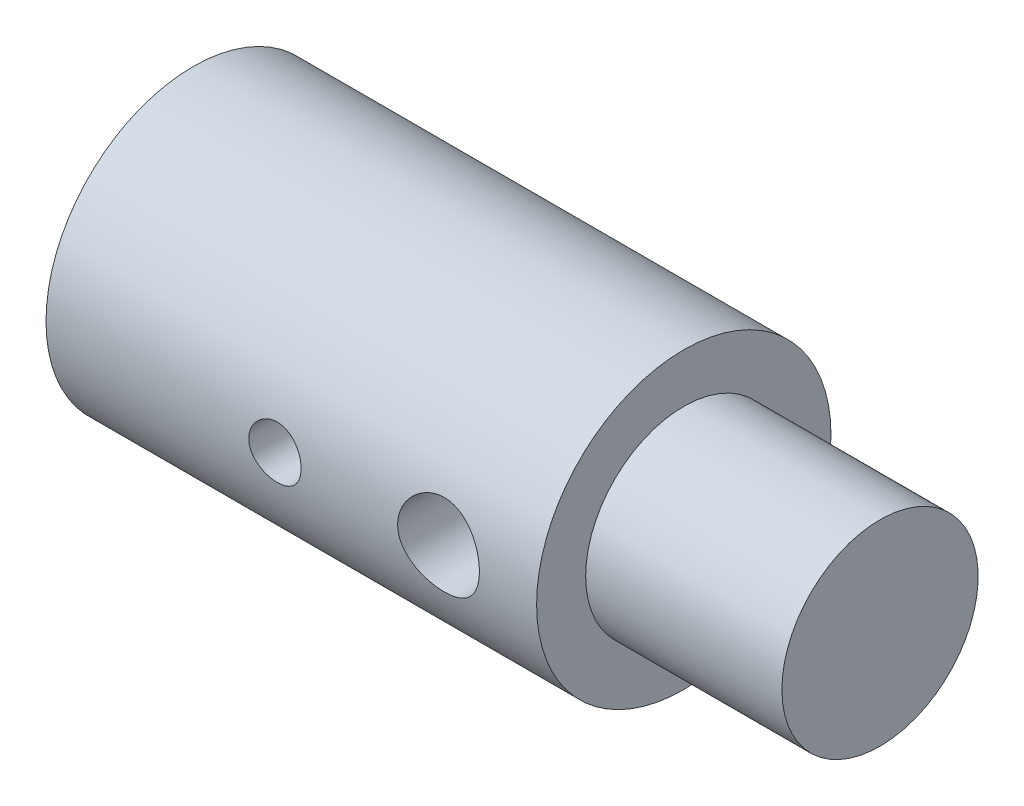
ISO-10303-21;
HEADER;
FILE_DESCRIPTION(('STEP AP214'),'2;1');
FILE_NAME('part.step','',(''),(''),'','','');
FILE_SCHEMA(('AUTOMOTIVE_DESIGN { 1 0 10303 214 1 1 1 1 }'));
ENDSEC;
DATA;
#1=APPLICATION_CONTEXT('core data for automotive mechanical design processes');
#2=APPLICATION_PROTOCOL_DEFINITION('international standard','automotive_design',2000,#1);
#3=PRODUCT_CONTEXT('',#1,'mechanical');
#4=PRODUCT('Part','Part','',(#3));
#5=PRODUCT_RELATED_PRODUCT_CATEGORY('part','',(#4));
#6=PRODUCT_DEFINITION_FORMATION('','',#4);
#7=PRODUCT_DEFINITION_CONTEXT('part definition',#1,'design');
#8=PRODUCT_DEFINITION('design','',#6,#7);
#9=PRODUCT_DEFINITION_SHAPE('','',#8);
#10=(LENGTH_UNIT() NAMED_UNIT(*) SI_UNIT(.MILLI.,.METRE.));
#11=(NAMED_UNIT(*) PLANE_ANGLE_UNIT() SI_UNIT($,.RADIAN.));
#12=(NAMED_UNIT(*) SI_UNIT($,.STERADIAN.) SOLID_ANGLE_UNIT());
#13=UNCERTAINTY_MEASURE_WITH_UNIT(LENGTH_MEASURE(1.E-05),#10,'distance_accuracy_value','');
#14=(GEOMETRIC_REPRESENTATION_CONTEXT(3) GLOBAL_UNCERTAINTY_ASSIGNED_CONTEXT((#13)) GLOBAL_UNIT_ASSIGNED_CONTEXT((#10,
#11,#12)) REPRESENTATION_CONTEXT('',''));
#15=CARTESIAN_POINT('',(0.,0.,0.));
#16=DIRECTION('',(0.,0.,1.));
#17=DIRECTION('',(1.,0.,0.));
#18=AXIS2_PLACEMENT_3D('',#15,#16,#17);
#19=CARTESIAN_POINT('',(0.,0.,0.));
#20=DIRECTION('',(-1.,0.,0.));
#21=DIRECTION('',(0.,0.,1.));
#22=AXIS2_PLACEMENT_3D('',#19,#20,#21);
#23=CYLINDRICAL_SURFACE('',#22,4.5);
#24=CARTESIAN_POINT('',(13.25,0.,-4.5));
#25=CARTESIAN_POINT('',(13.2499986004148,0.0688012508831792,-4.49999908016929));
#26=CARTESIAN_POINT('',(13.2443006801947,0.137617123752667,-4.49840674086833));
#27=CARTESIAN_POINT('',(13.2217042717347,0.273259475994238,-4.49220950198236));
#28=CARTESIAN_POINT('',(13.2048010582863,0.340085103663439,-4.48760333149253));
#29=CARTESIAN_POINT('',(13.1603912805861,0.469769949680302,-4.47588565394594));
#30=CARTESIAN_POINT('',(13.1328990313016,0.53263439009567,-4.46877753030964));
#31=CARTESIAN_POINT('',(13.0681464936731,0.652860695241772,-4.45280312581996));
#32=CARTESIAN_POINT('',(13.0308853380807,0.710222070812297,-4.44393668888688));
#33=CARTESIAN_POINT('',(12.9466705661571,0.819246784715924,-4.4251515781749));
#34=CARTESIAN_POINT('',(12.8995179603125,0.870753112808475,-4.41521373623696));
#35=CARTESIAN_POINT('',(12.7972837228784,0.965238185696339,-4.39552607117256));
#36=CARTESIAN_POINT('',(12.7422009777248,1.00821573084554,-4.38577627467017));
#37=CARTESIAN_POINT('',(12.6243927398707,1.08520808580323,-4.36737044294547));
#38=CARTESIAN_POINT('',(12.5615427915563,1.11903874947837,-4.35873847945984));
#39=CARTESIAN_POINT('',(12.4307680823599,1.1755895713114,-4.34382900808304));
#40=CARTESIAN_POINT('',(12.3628443495918,1.19831197336242,-4.33755102474248));
#41=CARTESIAN_POINT('',(12.2255972111459,1.23144924367956,-4.32825883142877));
#42=CARTESIAN_POINT('',(12.1563481783601,1.24215036904297,-4.32516886003198));
#43=CARTESIAN_POINT('',(12.0169741144372,1.25183427077973,-4.32237649384803));
#44=CARTESIAN_POINT('',(11.9468492651188,1.25081944027303,-4.3226734072502));
#45=CARTESIAN_POINT('',(11.8099777212773,1.2373267133762,-4.32655366801453));
#46=CARTESIAN_POINT('',(11.7431931985038,1.22519902270671,-4.33003660668585));
#47=CARTESIAN_POINT('',(11.6126463714084,1.19038731201905,-4.33973517053475));
#48=CARTESIAN_POINT('',(11.5488843273977,1.16770238457158,-4.3459510306134));
#49=CARTESIAN_POINT('',(11.4252977685447,1.11214373134465,-4.36050069775752));
#50=CARTESIAN_POINT('',(11.3655301331899,1.07915021836991,-4.36885918600197));
#51=CARTESIAN_POINT('',(11.2522584244088,1.00399440679636,-4.386739506843));
#52=CARTESIAN_POINT('',(11.1987556812739,0.961830166290604,-4.39626158564315));
#53=CARTESIAN_POINT('',(11.0975361195636,0.867755610284442,-4.41581072126827));
#54=CARTESIAN_POINT('',(11.0500923651201,0.815552279702357,-4.42584370037791));
#55=CARTESIAN_POINT('',(10.9645742692222,0.703806607201037,-4.44498199810828));
#56=CARTESIAN_POINT('',(10.9265003618975,0.644263925421966,-4.45408727373461));
#57=CARTESIAN_POINT('',(10.8606681843699,0.519083429338116,-4.47040839712755));
#58=CARTESIAN_POINT('',(10.8329628960611,0.453416395747749,-4.47761448645532));
#59=CARTESIAN_POINT('',(10.7890659015586,0.318109988769716,-4.48925492501446));
#60=CARTESIAN_POINT('',(10.7728714578434,0.248471564121132,-4.49368993323699));
#61=CARTESIAN_POINT('',(10.752892863221,0.109526607713143,-4.49918736483408));
#62=CARTESIAN_POINT('',(10.7487378550928,0.0402773058586824,-4.5003505382403));
#63=CARTESIAN_POINT('',(10.7519269982924,-0.0979299306365661,-4.49946480293159));
#64=CARTESIAN_POINT('',(10.759269851648,-0.166887897284517,-4.49741625678167));
#65=CARTESIAN_POINT('',(10.7849433341196,-0.301206913470859,-4.49040265059029));
#66=CARTESIAN_POINT('',(10.8030639450575,-0.366611288163866,-4.4854933716758));
#67=CARTESIAN_POINT('',(10.8495318676381,-0.49344311811872,-4.47331829169354));
#68=CARTESIAN_POINT('',(10.8778803325695,-0.554870123972382,-4.46605222488463));
#69=CARTESIAN_POINT('',(10.9446658780465,-0.673420140405416,-4.44973740284175));
#70=CARTESIAN_POINT('',(10.9833005243227,-0.730427061953541,-4.44065471340565));
#71=CARTESIAN_POINT('',(11.0693161358075,-0.837277670587,-4.42175477128212));
#72=CARTESIAN_POINT('',(11.1166989800658,-0.887119814631375,-4.41193736105189));
#73=CARTESIAN_POINT('',(11.2206014438783,-0.979812026944952,-4.39229842684379));
#74=CARTESIAN_POINT('',(11.2773574515576,-1.02239957885383,-4.3824860820796));
#75=CARTESIAN_POINT('',(11.3974206378797,-1.09745581429008,-4.36429693304267));
#76=CARTESIAN_POINT('',(11.4607275658426,-1.12992488482463,-4.35592007387163));
#77=CARTESIAN_POINT('',(11.5918071698832,-1.18358105834153,-4.34164798956173));
#78=CARTESIAN_POINT('',(11.6595526377546,-1.20483077484783,-4.3357390309604));
#79=CARTESIAN_POINT('',(11.7978497094168,-1.23557652495357,-4.32707876892783));
#80=CARTESIAN_POINT('',(11.8684005146331,-1.24507587906573,-4.32432657344886));
#81=CARTESIAN_POINT('',(12.0076057794908,-1.25184859974322,-4.32237038329875));
#82=CARTESIAN_POINT('',(12.0762381900119,-1.24954571014582,-4.32304340461176));
#83=CARTESIAN_POINT('',(12.2120948937947,-1.23377143287258,-4.32757137052123));
#84=CARTESIAN_POINT('',(12.2793192292682,-1.22030038049411,-4.33142621959091));
#85=CARTESIAN_POINT('',(12.4098672339181,-1.18282724248615,-4.34180718808003));
#86=CARTESIAN_POINT('',(12.4732208426478,-1.15892214641117,-4.34830866913275));
#87=CARTESIAN_POINT('',(12.5950674225073,-1.10133451670734,-4.36324916052054));
#88=CARTESIAN_POINT('',(12.6535595714857,-1.06765033358688,-4.37168849767404));
#89=CARTESIAN_POINT('',(12.7660276528252,-0.990206962020975,-4.38988810785379));
#90=CARTESIAN_POINT('',(12.8198014766827,-0.946162084346269,-4.39968178982262));
#91=CARTESIAN_POINT('',(12.9193323720535,-0.849781527450665,-4.41930831909362));
#92=CARTESIAN_POINT('',(12.965087452891,-0.797443795628193,-4.4291411755031));
#93=CARTESIAN_POINT('',(13.0483581365781,-0.684460232307883,-4.44801839581548));
#94=CARTESIAN_POINT('',(13.0856516233107,-0.623646258932176,-4.45703841192792));
#95=CARTESIAN_POINT('',(13.1494281392895,-0.496361982692843,-4.47299974900605));
#96=CARTESIAN_POINT('',(13.175917518581,-0.429895030176727,-4.47994229035335));
#97=CARTESIAN_POINT('',(13.2142200807347,-0.303145483766702,-4.4901607483195));
#98=CARTESIAN_POINT('',(13.2276047875929,-0.243364402168743,-4.49382245661855));
#99=CARTESIAN_POINT('',(13.2454948458225,-0.12239262569341,-4.49874234976285));
#100=CARTESIAN_POINT('',(13.2500012449999,-0.0612020980194156,-4.50000081823467));
#101=CARTESIAN_POINT('',(13.25,0.,-4.5));
#102=B_SPLINE_CURVE_WITH_KNOTS('',3,(#24,#25,#26,#27,#28,#29,#30,#31,#32,#33,#34,#35,#36,#37,
#38,#39,#40,#41,#42,#43,#44,#45,#46,#47,#48,#49,#50,#51,#52,#53,#54,#55,#56,#57,#58,#59,#60,#61,
#62,#63,#64,#65,#66,#67,#68,#69,#70,#71,#72,#73,#74,#75,#76,#77,#78,#79,#80,#81,#82,#83,#84,#85,
#86,#87,#88,#89,#90,#91,#92,#93,#94,#95,#96,#97,#98,#99,#100,#101),.UNSPECIFIED.,.T.,.F.,(4,2,2,
2,2,2,2,2,2,2,2,2,2,2,2,2,2,2,2,2,2,2,2,2,2,2,2,2,2,2,2,2,2,2,2,2,2,2,4),(0.,0.20617919309949,
0.412445386147261,0.618433707942855,0.824440322837931,1.03507624325264,1.24574177043995,
1.46037690323672,1.67496866133384,1.8843343193919,2.09365721284144,2.29660232990422,
2.49956489399153,2.70497960040656,2.91043784592675,3.12319493838162,3.33596188658146,
3.5498016563595,3.76359055350007,3.97072010588427,4.17782627748477,4.38102317477487,
4.58424299163039,4.79168948884227,4.99918059600964,5.21305991702851,5.42693105668201,
5.63959564853972,5.85220013017267,6.05722599244308,6.26224569952549,6.46539893556025,
6.66858645848129,6.87821913273771,7.0879037754062,7.30258090584733,7.51713167871719,
7.7005598652503,7.88396640253935),.UNSPECIFIED.);
#103=CARTESIAN_POINT('',(13.25,0.,-4.5));
#104=VERTEX_POINT('',#103);
#105=EDGE_CURVE('E97',#104,#104,#102,.T.);
#106=ORIENTED_EDGE('',*,*,#105,.T.);
#107=EDGE_LOOP('',(#106));
#108=FACE_BOUND('',#107,.T.);
#109=CARTESIAN_POINT('',(13.25,0.,4.5));
#110=CARTESIAN_POINT('',(13.2499986004148,-0.0688012508831791,4.49999908016929));
#111=CARTESIAN_POINT('',(13.2443006801947,-0.137617123752667,4.49840674086833));
#112=CARTESIAN_POINT('',(13.2217042717347,-0.273259475994238,4.49220950198236));
#113=CARTESIAN_POINT('',(13.2048010582863,-0.340085103663439,4.48760333149253));
#114=CARTESIAN_POINT('',(13.1603912805861,-0.469769949680302,4.47588565394594));
#115=CARTESIAN_POINT('',(13.1328990313016,-0.53263439009567,4.46877753030964));
#116=CARTESIAN_POINT('',(13.0681464936731,-0.652860695241772,4.45280312581996));
#117=CARTESIAN_POINT('',(13.0308853380807,-0.710222070812297,4.44393668888688));
#118=CARTESIAN_POINT('',(12.9466705661571,-0.819246784715924,4.4251515781749));
#119=CARTESIAN_POINT('',(12.8995179603125,-0.870753112808474,4.41521373623696));
#120=CARTESIAN_POINT('',(12.7972837228784,-0.965238185696338,4.39552607117256));
#121=CARTESIAN_POINT('',(12.7422009777248,-1.00821573084554,4.38577627467017));
#122=CARTESIAN_POINT('',(12.6243927398707,-1.08520808580323,4.36737044294547));
#123=CARTESIAN_POINT('',(12.5615427915563,-1.11903874947837,4.35873847945984));
#124=CARTESIAN_POINT('',(12.4307680823599,-1.1755895713114,4.34382900808304));
#125=CARTESIAN_POINT('',(12.3628443495918,-1.19831197336242,4.33755102474248));
#126=CARTESIAN_POINT('',(12.2255972111459,-1.23144924367956,4.32825883142877));
#127=CARTESIAN_POINT('',(12.1563481783601,-1.24215036904297,4.32516886003198));
#128=CARTESIAN_POINT('',(12.0169741144372,-1.25183427077973,4.32237649384803));
#129=CARTESIAN_POINT('',(11.9468492651188,-1.25081944027303,4.3226734072502));
#130=CARTESIAN_POINT('',(11.8099777212773,-1.2373267133762,4.32655366801453));
#131=CARTESIAN_POINT('',(11.7431931985038,-1.22519902270671,4.33003660668585));
#132=CARTESIAN_POINT('',(11.6126463714084,-1.19038731201905,4.33973517053475));
#133=CARTESIAN_POINT('',(11.5488843273977,-1.16770238457158,4.3459510306134));
#134=CARTESIAN_POINT('',(11.4252977685447,-1.11214373134465,4.36050069775752));
#135=CARTESIAN_POINT('',(11.3655301331899,-1.07915021836991,4.36885918600197));
#136=CARTESIAN_POINT('',(11.2522584244088,-1.00399440679636,4.386739506843));
#137=CARTESIAN_POINT('',(11.1987556812739,-0.961830166290604,4.39626158564315));
#138=CARTESIAN_POINT('',(11.0975361195636,-0.867755610284442,4.41581072126827));
#139=CARTESIAN_POINT('',(11.0500923651201,-0.815552279702357,4.42584370037791));
#140=CARTESIAN_POINT('',(10.9645742692222,-0.703806607201037,4.44498199810828));
#141=CARTESIAN_POINT('',(10.9265003618975,-0.644263925421966,4.45408727373461));
#142=CARTESIAN_POINT('',(10.8606681843699,-0.519083429338116,4.47040839712755));
#143=CARTESIAN_POINT('',(10.8329628960611,-0.453416395747749,4.47761448645532));
#144=CARTESIAN_POINT('',(10.7890659015586,-0.318109988769716,4.48925492501446));
#145=CARTESIAN_POINT('',(10.7728714578434,-0.248471564121132,4.49368993323699));
#146=CARTESIAN_POINT('',(10.752892863221,-0.109526607713143,4.49918736483408));
#147=CARTESIAN_POINT('',(10.7487378550928,-0.0402773058586822,4.5003505382403));
#148=CARTESIAN_POINT('',(10.7519269982924,0.0979299306365663,4.49946480293159));
#149=CARTESIAN_POINT('',(10.759269851648,0.166887897284518,4.49741625678167));
#150=CARTESIAN_POINT('',(10.7849433341196,0.30120691347086,4.49040265059029));
#151=CARTESIAN_POINT('',(10.8030639450575,0.366611288163866,4.4854933716758));
#152=CARTESIAN_POINT('',(10.8495318676381,0.49344311811872,4.47331829169354));
#153=CARTESIAN_POINT('',(10.8778803325695,0.554870123972381,4.46605222488463));
#154=CARTESIAN_POINT('',(10.9446658780465,0.673420140405416,4.44973740284175));
#155=CARTESIAN_POINT('',(10.9833005243227,0.730427061953542,4.44065471340565));
#156=CARTESIAN_POINT('',(11.0693161358075,0.837277670587,4.42175477128212));
#157=CARTESIAN_POINT('',(11.1166989800658,0.887119814631376,4.41193736105189));
#158=CARTESIAN_POINT('',(11.2206014438783,0.979812026944952,4.39229842684379));
#159=CARTESIAN_POINT('',(11.2773574515576,1.02239957885383,4.3824860820796));
#160=CARTESIAN_POINT('',(11.3974206378797,1.09745581429008,4.36429693304267));
#161=CARTESIAN_POINT('',(11.4607275658426,1.12992488482463,4.35592007387163));
#162=CARTESIAN_POINT('',(11.5918071698832,1.18358105834153,4.34164798956173));
#163=CARTESIAN_POINT('',(11.6595526377546,1.20483077484783,4.3357390309604));
#164=CARTESIAN_POINT('',(11.7978497094168,1.23557652495357,4.32707876892783));
#165=CARTESIAN_POINT('',(11.8684005146331,1.24507587906573,4.32432657344886));
#166=CARTESIAN_POINT('',(12.0076057794908,1.25184859974322,4.32237038329875));
#167=CARTESIAN_POINT('',(12.0762381900119,1.24954571014582,4.32304340461176));
#168=CARTESIAN_POINT('',(12.2120948937947,1.23377143287258,4.32757137052123));
#169=CARTESIAN_POINT('',(12.2793192292682,1.22030038049411,4.33142621959091));
#170=CARTESIAN_POINT('',(12.4098672339181,1.18282724248615,4.34180718808003));
#171=CARTESIAN_POINT('',(12.4732208426478,1.15892214641117,4.34830866913275));
#172=CARTESIAN_POINT('',(12.5950674225073,1.10133451670734,4.36324916052054));
#173=CARTESIAN_POINT('',(12.6535595714857,1.06765033358688,4.37168849767404));
#174=CARTESIAN_POINT('',(12.7660276528252,0.990206962020974,4.38988810785379));
#175=CARTESIAN_POINT('',(12.8198014766827,0.946162084346268,4.39968178982262));
#176=CARTESIAN_POINT('',(12.9193323720535,0.849781527450665,4.41930831909362));
#177=CARTESIAN_POINT('',(12.965087452891,0.797443795628193,4.4291411755031));
#178=CARTESIAN_POINT('',(13.0483581365781,0.684460232307883,4.44801839581548));
#179=CARTESIAN_POINT('',(13.0856516233107,0.623646258932176,4.45703841192792));
#180=CARTESIAN_POINT('',(13.1494281392895,0.496361982692843,4.47299974900605));
#181=CARTESIAN_POINT('',(13.175917518581,0.429895030176727,4.47994229035335));
#182=CARTESIAN_POINT('',(13.2142200807347,0.303145483766702,4.4901607483195));
#183=CARTESIAN_POINT('',(13.2276047875929,0.243364402168743,4.49382245661855));
#184=CARTESIAN_POINT('',(13.2454948458225,0.12239262569341,4.49874234976285));
#185=CARTESIAN_POINT('',(13.2500012449999,0.0612020980194157,4.50000081823467));
#186=CARTESIAN_POINT('',(13.25,0.,4.5));
#187=B_SPLINE_CURVE_WITH_KNOTS('',3,(#109,#110,#111,#112,#113,#114,#115,#116,#117,#118,#119,
#120,#121,#122,#123,#124,#125,#126,#127,#128,#129,#130,#131,#132,#133,#134,#135,#136,#137,#138,
#139,#140,#141,#142,#143,#144,#145,#146,#147,#148,#149,#150,#151,#152,#153,#154,#155,#156,#157,
#158,#159,#160,#161,#162,#163,#164,#165,#166,#167,#168,#169,#170,#171,#172,#173,#174,#175,#176,
#177,#178,#179,#180,#181,#182,#183,#184,#185,#186),.UNSPECIFIED.,.T.,.F.,(4,2,2,2,2,2,2,2,2,2,2,
2,2,2,2,2,2,2,2,2,2,2,2,2,2,2,2,2,2,2,2,2,2,2,2,2,2,2,4),(0.,0.20617919309949,0.41244538614726,
0.618433707942855,0.82444032283793,1.03507624325264,1.24574177043995,1.46037690323672,
1.67496866133384,1.8843343193919,2.09365721284144,2.29660232990422,2.49956489399153,
2.70497960040656,2.91043784592675,3.12319493838162,3.33596188658146,3.5498016563595,
3.76359055350007,3.97072010588427,4.17782627748477,4.38102317477487,4.58424299163039,
4.79168948884227,4.99918059600964,5.21305991702851,5.42693105668201,5.63959564853972,
5.85220013017267,6.05722599244308,6.26224569952549,6.46539893556025,6.66858645848129,
6.87821913273771,7.0879037754062,7.30258090584733,7.51713167871719,7.7005598652503,
7.88396640253935),.UNSPECIFIED.);
#188=CARTESIAN_POINT('',(13.25,0.,4.5));
#189=VERTEX_POINT('',#188);
#190=EDGE_CURVE('E203',#189,#189,#187,.T.);
#191=ORIENTED_EDGE('',*,*,#190,.T.);
#192=EDGE_LOOP('',(#191));
#193=FACE_BOUND('',#192,.T.);
#194=CARTESIAN_POINT('',(6.20000000000001,0.,4.5));
#195=CARTESIAN_POINT('',(6.20000174500124,0.0445599944511058,4.4999992105062));
#196=CARTESIAN_POINT('',(6.20373556648194,0.0891431869059652,4.49933127269273));
#197=CARTESIAN_POINT('',(6.21856422299493,0.177056081488532,4.49673108581177));
#198=CARTESIAN_POINT('',(6.22966553814751,0.220384645056034,4.49479772375394));
#199=CARTESIAN_POINT('',(6.25888085396563,0.304503908341068,4.48988323923955));
#200=CARTESIAN_POINT('',(6.27698880684739,0.345296761610666,4.48690302058187));
#201=CARTESIAN_POINT('',(6.31968683870222,0.423260819916551,4.48022133695395));
#202=CARTESIAN_POINT('',(6.34427628948374,0.460432375453759,4.47651994188972));
#203=CARTESIAN_POINT('',(6.39952194520398,0.530505214569471,4.46876053693121));
#204=CARTESIAN_POINT('',(6.43023460469286,0.563361649877269,4.46469942018057));
#205=CARTESIAN_POINT('',(6.49673337361036,0.623483866791267,4.45670168733634));
#206=CARTESIAN_POINT('',(6.53251982534165,0.650749270895478,4.45276507966468));
#207=CARTESIAN_POINT('',(6.60846305347863,0.699098750783088,4.44543195001283));
#208=CARTESIAN_POINT('',(6.6486489092434,0.720137812784376,4.44203943857662));
#209=CARTESIAN_POINT('',(6.73205494879309,0.755149375735973,4.4362220868588));
#210=CARTESIAN_POINT('',(6.77527489810219,0.769122422067297,4.43379717189759));
#211=CARTESIAN_POINT('',(6.86304448235446,0.789462626371859,4.43022068885813));
#212=CARTESIAN_POINT('',(6.90757553607279,0.795907629517034,4.42905609757913));
#213=CARTESIAN_POINT('',(6.9971010308134,0.801250297286223,4.42809279824557));
#214=CARTESIAN_POINT('',(7.04209543422275,0.800148569777006,4.42829398018201));
#215=CARTESIAN_POINT('',(7.13071042803527,0.790492309077643,4.43002762272544));
#216=CARTESIAN_POINT('',(7.17434096040703,0.782025776577776,4.43154436334921));
#217=CARTESIAN_POINT('',(7.25955226972143,0.758018594493089,4.43571357461903));
#218=CARTESIAN_POINT('',(7.30113296752241,0.742477672011249,4.4383660890777));
#219=CARTESIAN_POINT('',(7.38132463119045,0.704675286447835,4.44452467379717));
#220=CARTESIAN_POINT('',(7.41991825435445,0.682377806181796,4.44803529850068));
#221=CARTESIAN_POINT('',(7.49284948045757,0.631720767881608,4.45551146323876));
#222=CARTESIAN_POINT('',(7.52718669337333,0.603360654964094,4.45947704489794));
#223=CARTESIAN_POINT('',(7.59113929793212,0.540906518650161,4.46748507923883));
#224=CARTESIAN_POINT('',(7.62068108452127,0.506737111346533,4.47152782616641));
#225=CARTESIAN_POINT('',(7.67362360818996,0.433887873664048,4.47918301924728));
#226=CARTESIAN_POINT('',(7.6970242949151,0.395208006305101,4.48279546187214));
#227=CARTESIAN_POINT('',(7.73702919901549,0.314362693626078,4.48918923602904));
#228=CARTESIAN_POINT('',(7.75362631613044,0.272193661847006,4.49196969848705));
#229=CARTESIAN_POINT('',(7.77948148040013,0.185605949668321,4.49637940000599));
#230=CARTESIAN_POINT('',(7.7887402272949,0.141187484190129,4.49800874882815));
#231=CARTESIAN_POINT('',(7.79955466386688,0.0519955842873786,4.49991771582439));
#232=CARTESIAN_POINT('',(7.80121129597996,0.00723475484142859,4.50021501989789));
#233=CARTESIAN_POINT('',(7.79704445104301,-0.0819245608493668,4.49947505437087));
#234=CARTESIAN_POINT('',(7.79122130299149,-0.126323062944758,4.49843784346905));
#235=CARTESIAN_POINT('',(7.77234414258762,-0.213181265750265,4.49515637034946));
#236=CARTESIAN_POINT('',(7.75934067796172,-0.255652298730736,4.49292054923401));
#237=CARTESIAN_POINT('',(7.72652631306216,-0.337811503894585,4.48749150787854));
#238=CARTESIAN_POINT('',(7.70671498797359,-0.377499502228665,4.48429822789406));
#239=CARTESIAN_POINT('',(7.66062012846491,-0.45340053552691,4.4772644318922));
#240=CARTESIAN_POINT('',(7.63427425226624,-0.48957513227449,4.47341780117456));
#241=CARTESIAN_POINT('',(7.57594317923791,-0.557025922825162,4.46552096315961));
#242=CARTESIAN_POINT('',(7.54395751244815,-0.588301708003001,4.4614707389171));
#243=CARTESIAN_POINT('',(7.47479982524303,-0.645446143234085,4.4535652344551));
#244=CARTESIAN_POINT('',(7.43757076678499,-0.671246227953773,4.44971283774816));
#245=CARTESIAN_POINT('',(7.35924777147296,-0.716226372534343,4.44269514798421));
#246=CARTESIAN_POINT('',(7.31815396878206,-0.735406662090958,4.43952983108809));
#247=CARTESIAN_POINT('',(7.23345052489493,-0.76650296458845,4.43426684579865));
#248=CARTESIAN_POINT('',(7.1898532088758,-0.778451700039768,4.43216437529796));
#249=CARTESIAN_POINT('',(7.10122937361629,-0.794847677147893,4.42925363059009));
#250=CARTESIAN_POINT('',(7.05620299808857,-0.79929567069313,4.42844522666367));
#251=CARTESIAN_POINT('',(6.9666849115136,-0.800540742354149,4.42822025532186));
#252=CARTESIAN_POINT('',(6.92219471612174,-0.7974458568563,4.42878403402657));
#253=CARTESIAN_POINT('',(6.83437920512749,-0.783928148300325,4.43119656754119));
#254=CARTESIAN_POINT('',(6.79105388417185,-0.773505358923916,4.43304531644491));
#255=CARTESIAN_POINT('',(6.70684824695834,-0.745671304177245,4.43781159096408));
#256=CARTESIAN_POINT('',(6.66596434584432,-0.728270589949581,4.44072750237131));
#257=CARTESIAN_POINT('',(6.5876787859153,-0.686986074147885,4.44730088287819));
#258=CARTESIAN_POINT('',(6.55027733850572,-0.663101879332623,4.45095839695473));
#259=CARTESIAN_POINT('',(6.47947492702759,-0.609147973749612,4.45866451251122));
#260=CARTESIAN_POINT('',(6.4461346919219,-0.578999215356943,4.46271772160394));
#261=CARTESIAN_POINT('',(6.38495007334157,-0.513537820189473,4.47072298312656));
#262=CARTESIAN_POINT('',(6.35710695596798,-0.478223997045135,4.47467501207055));
#263=CARTESIAN_POINT('',(6.30750151094107,-0.403098638391699,4.48206940099772));
#264=CARTESIAN_POINT('',(6.28578944198533,-0.363253483491107,4.48550744558468));
#265=CARTESIAN_POINT('',(6.24940142099613,-0.280434482871198,4.49144447674611));
#266=CARTESIAN_POINT('',(6.23471866721443,-0.23746370816299,4.49394437059121));
#267=CARTESIAN_POINT('',(6.21588678482421,-0.161955352943685,4.49719641064708));
#268=CARTESIAN_POINT('',(6.20993911022775,-0.129866914867117,4.49824197346458));
#269=CARTESIAN_POINT('',(6.20199512143958,-0.0651897831779776,4.4996440496288));
#270=CARTESIAN_POINT('',(6.19999872331762,-0.032601100206077,4.50000057761152));
#271=CARTESIAN_POINT('',(6.20000000000001,0.,4.5));
#272=B_SPLINE_CURVE_WITH_KNOTS('',3,(#194,#195,#196,#197,#198,#199,#200,#201,#202,#203,#204,
#205,#206,#207,#208,#209,#210,#211,#212,#213,#214,#215,#216,#217,#218,#219,#220,#221,#222,#223,
#224,#225,#226,#227,#228,#229,#230,#231,#232,#233,#234,#235,#236,#237,#238,#239,#240,#241,#242,
#243,#244,#245,#246,#247,#248,#249,#250,#251,#252,#253,#254,#255,#256,#257,#258,#259,#260,#261,
#262,#263,#264,#265,#266,#267,#268,#269,#270,#271),.UNSPECIFIED.,.T.,.F.,(4,2,2,2,2,2,2,2,2,2,2,
2,2,2,2,2,2,2,2,2,2,2,2,2,2,2,2,2,2,2,2,2,2,2,2,2,2,2,4),(0.,0.133560787307614,
0.267239204719188,0.400802493989525,0.534352842964275,0.669196734750359,0.804049728093324,
0.939855083372446,1.07564995509549,1.21002782142156,1.34439486413637,1.4771780973117,
1.60996645307989,1.74347550247011,1.87699677653181,2.01240541123725,2.14781515620096,
2.28336585829403,2.41890363358383,2.55263640156711,2.68636328750941,2.81916055309513,
2.95196610682171,3.08609099284346,3.22022706069195,3.35595479969539,3.49167782870151,
3.6267820327491,3.76187269289278,3.89503985407062,4.02820640316768,4.16117234921644,
4.29414636182435,4.42891302912826,4.56371069989326,4.69958324903566,4.83532405729453,
4.9330422270718,5.03075832116593),.UNSPECIFIED.);
#273=CARTESIAN_POINT('',(6.20000000000001,0.,4.5));
#274=VERTEX_POINT('',#273);
#275=EDGE_CURVE('E11',#274,#274,#272,.T.);
#276=ORIENTED_EDGE('',*,*,#275,.T.);
#277=EDGE_LOOP('',(#276));
#278=FACE_BOUND('',#277,.T.);
#279=CARTESIAN_POINT('',(0.,0.,0.));
#280=DIRECTION('',(-1.,0.,0.));
#281=DIRECTION('',(0.,0.,1.));
#282=AXIS2_PLACEMENT_3D('',#279,#280,#281);
#283=CIRCLE('',#282,4.5);
#284=CARTESIAN_POINT('',(0.,0.,4.5));
#285=VERTEX_POINT('',#284);
#286=EDGE_CURVE('E48',#285,#285,#283,.T.);
#287=ORIENTED_EDGE('',*,*,#286,.F.);
#288=EDGE_LOOP('',(#287));
#289=FACE_BOUND('',#288,.T.);
#290=CARTESIAN_POINT('',(15.,0.,0.));
#291=DIRECTION('',(-1.,0.,0.));
#292=DIRECTION('',(0.,0.,1.));
#293=AXIS2_PLACEMENT_3D('',#290,#291,#292);
#294=CIRCLE('',#293,4.5);
#295=CARTESIAN_POINT('',(15.,0.,4.5));
#296=VERTEX_POINT('',#295);
#297=EDGE_CURVE('E96',#296,#296,#294,.T.);
#298=ORIENTED_EDGE('',*,*,#297,.T.);
#299=EDGE_LOOP('',(#298));
#300=FACE_BOUND('',#299,.T.);
#301=ADVANCED_FACE('F36',(#108,#193,#278,#289,#300),#23,.T.);
#302=CARTESIAN_POINT('',(0.,4.5,0.));
#303=DIRECTION('',(1.,0.,0.));
#304=DIRECTION('',(0.,0.,-1.));
#305=AXIS2_PLACEMENT_3D('',#302,#303,#304);
#306=PLANE('',#305);
#307=CARTESIAN_POINT('',(0.,0.,0.));
#308=DIRECTION('',(-1.,0.,0.));
#309=DIRECTION('',(0.,0.,1.));
#310=AXIS2_PLACEMENT_3D('',#307,#308,#309);
#311=CIRCLE('',#310,2.);
#312=CARTESIAN_POINT('',(0.,0.,2.));
#313=VERTEX_POINT('',#312);
#314=EDGE_CURVE('E62',#313,#313,#311,.T.);
#315=ORIENTED_EDGE('',*,*,#314,.F.);
#316=EDGE_LOOP('',(#315));
#317=FACE_BOUND('',#316,.T.);
#318=ORIENTED_EDGE('',*,*,#286,.T.);
#319=EDGE_LOOP('',(#318));
#320=FACE_BOUND('',#319,.T.);
#321=ADVANCED_FACE('F103',(#317,#320),#306,.F.);
#322=CARTESIAN_POINT('',(0.,0.,0.));
#323=DIRECTION('',(-1.,0.,0.));
#324=DIRECTION('',(0.,0.,1.));
#325=AXIS2_PLACEMENT_3D('',#322,#323,#324);
#326=CYLINDRICAL_SURFACE('',#325,2.);
#327=CARTESIAN_POINT('',(13.25,0.,2.));
#328=CARTESIAN_POINT('',(13.2499956500012,0.0635104730002027,1.99999595305313));
#329=CARTESIAN_POINT('',(13.2451269881822,0.127096441053758,1.99694323311001));
#330=CARTESIAN_POINT('',(13.2259141965705,0.252318262265282,1.98502167724102));
#331=CARTESIAN_POINT('',(13.2115520060745,0.313950163299073,1.97614175574896));
#332=CARTESIAN_POINT('',(13.1741886368379,0.433205558136783,1.95345852982134));
#333=CARTESIAN_POINT('',(13.1512302121591,0.490847243665017,1.93967960778663));
#334=CARTESIAN_POINT('',(13.0976141492032,0.601260368868361,1.90834598486073));
#335=CARTESIAN_POINT('',(13.0669573639908,0.654032347276152,1.89079170235271));
#336=CARTESIAN_POINT('',(12.996113426815,0.757974192167973,1.85170152902273));
#337=CARTESIAN_POINT('',(12.9553607000246,0.808679560769978,1.82995962224617));
#338=CARTESIAN_POINT('',(12.8667808254934,0.90298637514676,1.78531349913632));
#339=CARTESIAN_POINT('',(12.8189441717421,0.946578107215734,1.76240774858553));
#340=CARTESIAN_POINT('',(12.7099661057955,1.03142873237132,1.71430418655199));
#341=CARTESIAN_POINT('',(12.6479002133927,1.07157206029151,1.68921610993412));
#342=CARTESIAN_POINT('',(12.5164351845528,1.14073966020039,1.64330198128731));
#343=CARTESIAN_POINT('',(12.4470486874239,1.16978270899534,1.62246875996238));
#344=CARTESIAN_POINT('',(12.3211894762213,1.20933400585981,1.59309575627364));
#345=CARTESIAN_POINT('',(12.2660331814612,1.22269552371394,1.58276905990074));
#346=CARTESIAN_POINT('',(12.1536940743892,1.2418184358548,1.56781357325805));
#347=CARTESIAN_POINT('',(12.0965142417255,1.24759056342088,1.56317673673692));
#348=CARTESIAN_POINT('',(11.9815869832489,1.2511891824572,1.56029885782827));
#349=CARTESIAN_POINT('',(11.9238384635376,1.24899483727851,1.56207458771718));
#350=CARTESIAN_POINT('',(11.809689896811,1.23676317046804,1.5717740238392));
#351=CARTESIAN_POINT('',(11.7532909679609,1.22671956265044,1.5797026576711));
#352=CARTESIAN_POINT('',(11.6445615473425,1.19968103371474,1.60032573121781));
#353=CARTESIAN_POINT('',(11.5921675443157,1.18285016736897,1.61290715104814));
#354=CARTESIAN_POINT('',(11.4908388175946,1.14290189820938,1.64145566443406));
#355=CARTESIAN_POINT('',(11.4419053251255,1.11978227193696,1.65742395501353));
#356=CARTESIAN_POINT('',(11.3391667261673,1.06294892954949,1.69454815993019));
#357=CARTESIAN_POINT('',(11.2861591898796,1.02806296601171,1.71611591575959));
#358=CARTESIAN_POINT('',(11.1861697209995,0.950881463002106,1.76005711791243));
#359=CARTESIAN_POINT('',(11.1391940682935,0.908578308011442,1.78243137335975));
#360=CARTESIAN_POINT('',(11.0446982506296,0.809519713023337,1.82979894916857));
#361=CARTESIAN_POINT('',(10.9983670257412,0.751531353595339,1.85461531676593));
#362=CARTESIAN_POINT('',(10.9161491041128,0.627148099593575,1.90028055062445));
#363=CARTESIAN_POINT('',(10.8802583022711,0.560756523882004,1.92113097514764));
#364=CARTESIAN_POINT('',(10.8222363116186,0.424883562934753,1.95553372961316));
#365=CARTESIAN_POINT('',(10.7994659600188,0.355763457732375,1.96941976591574));
#366=CARTESIAN_POINT('',(10.7662350720172,0.21361215457498,1.98984929310048));
#367=CARTESIAN_POINT('',(10.755757105778,0.140586648341309,1.9964031799007));
#368=CARTESIAN_POINT('',(10.7484341499388,0.00451561874059274,2.00097840540091));
#369=CARTESIAN_POINT('',(10.7497968220461,-0.0584027741637805,2.00012161345511));
#370=CARTESIAN_POINT('',(10.7618828284207,-0.182972117996305,1.99258901494327));
#371=CARTESIAN_POINT('',(10.7726055250922,-0.244623154962729,1.98591360473591));
#372=CARTESIAN_POINT('',(10.802238536692,-0.362521070658186,1.9677405228307));
#373=CARTESIAN_POINT('',(10.8208121567966,-0.418885009953201,1.95644170526844));
#374=CARTESIAN_POINT('',(10.8652963892786,-0.527638281070985,1.92995684104752));
#375=CARTESIAN_POINT('',(10.8912082302552,-0.580026945470712,1.91477014350266));
#376=CARTESIAN_POINT('',(10.9525152059955,-0.685084056277254,1.87990012356));
#377=CARTESIAN_POINT('',(10.9886035692382,-0.737246967843402,1.85991764817225));
#378=CARTESIAN_POINT('',(11.0677938651528,-0.835142640217338,1.81806970001717));
#379=CARTESIAN_POINT('',(11.1109035892545,-0.880868151291852,1.79620214826384));
#380=CARTESIAN_POINT('',(11.2101350394126,-0.971474198022881,1.74905869713091));
#381=CARTESIAN_POINT('',(11.2672372062948,-1.01526851939752,1.72374883414957));
#382=CARTESIAN_POINT('',(11.3888757849443,-1.09280351885684,1.67566762748172));
#383=CARTESIAN_POINT('',(11.453407006753,-1.12655115718693,1.65289453322336));
#384=CARTESIAN_POINT('',(11.5746921480569,-1.17684772011828,1.61733530314592));
#385=CARTESIAN_POINT('',(11.6302407507322,-1.19551895865479,1.6034563619378));
#386=CARTESIAN_POINT('',(11.7443931457689,-1.22500108205245,1.58105030663767));
#387=CARTESIAN_POINT('',(11.8029920094515,-1.23582424983127,1.57251483242605));
#388=CARTESIAN_POINT('',(11.9220902768807,-1.24901383653654,1.56206324988731));
#389=CARTESIAN_POINT('',(11.9825985854882,-1.25133186963293,1.56018501674569));
#390=CARTESIAN_POINT('',(12.103130960366,-1.24719778716818,1.56349063109847));
#391=CARTESIAN_POINT('',(12.1631548590095,-1.24074275650143,1.56867682595586));
#392=CARTESIAN_POINT('',(12.2760297950514,-1.220382724034,1.58455388771334));
#393=CARTESIAN_POINT('',(12.3290693014164,-1.2071191949977,1.5947680805106));
#394=CARTESIAN_POINT('',(12.4321350595859,-1.17417623469513,1.6191753043569));
#395=CARTESIAN_POINT('',(12.4821600445375,-1.15449412799407,1.63336999423727));
#396=CARTESIAN_POINT('',(12.5855967438727,-1.10602690439618,1.66663902886518));
#397=CARTESIAN_POINT('',(12.6384502984765,-1.07633644455461,1.68612230498997));
#398=CARTESIAN_POINT('',(12.738938367246,-1.0100001703639,1.72667706411868));
#399=CARTESIAN_POINT('',(12.7865686125605,-0.973348732866948,1.74774982276825));
#400=CARTESIAN_POINT('',(12.8850142549778,-0.885670221416068,1.79401910731181));
#401=CARTESIAN_POINT('',(12.9345908454455,-0.833233674246803,1.81920541808776));
#402=CARTESIAN_POINT('',(13.0244948297052,-0.719822446025212,1.86698729056748));
#403=CARTESIAN_POINT('',(13.0648164959274,-0.658842515138558,1.88958124364394));
#404=CARTESIAN_POINT('',(13.1347711301241,-0.529355399891416,1.92986710976548));
#405=CARTESIAN_POINT('',(13.1643860054058,-0.460835727056579,1.94755071355356));
#406=CARTESIAN_POINT('',(13.2110718843317,-0.318394712729507,1.97581521637842));
#407=CARTESIAN_POINT('',(13.2281872348698,-0.244493501106858,1.98642121428689));
#408=CARTESIAN_POINT('',(13.2422992091626,-0.14141848122467,1.99519472168143));
#409=CARTESIAN_POINT('',(13.245181865334,-0.113248608862874,1.99699172226301));
#410=CARTESIAN_POINT('',(13.2490332915376,-0.0567241864870921,1.9993953021324));
#411=CARTESIAN_POINT('',(13.25000194311,-0.0283696251514539,2.00000180773911));
#412=CARTESIAN_POINT('',(13.25,0.,2.));
#413=B_SPLINE_CURVE_WITH_KNOTS('',3,(#327,#328,#329,#330,#331,#332,#333,#334,#335,#336,#337,
#338,#339,#340,#341,#342,#343,#344,#345,#346,#347,#348,#349,#350,#351,#352,#353,#354,#355,#356,
#357,#358,#359,#360,#361,#362,#363,#364,#365,#366,#367,#368,#369,#370,#371,#372,#373,#374,#375,
#376,#377,#378,#379,#380,#381,#382,#383,#384,#385,#386,#387,#388,#389,#390,#391,#392,#393,#394,
#395,#396,#397,#398,#399,#400,#401,#402,#403,#404,#405,#406,#407,#408,#409,#410,#411,#412),
.UNSPECIFIED.,.T.,.F.,(4,2,2,2,2,2,2,2,2,2,2,2,2,2,2,2,2,2,2,2,2,2,2,2,2,2,2,2,2,2,2,2,2,2,2,2,
2,2,2,2,2,2,4),(0.,0.190412301434133,0.381187894128462,0.571026987595137,0.760845054038796,
0.96582187053622,1.17107628325702,1.40412975852973,1.6367872460701,1.80912008879717,
1.98120894707391,2.15374823498778,2.32642584505083,2.49515839460436,2.66395067908033,
2.86427450354359,3.06480522575181,3.29842180699522,3.53194640727861,3.75284174135959,
3.97342347958131,4.16127180597573,4.34910733732281,4.52959504531299,4.71011298928467,
4.90885230990553,5.10781368827686,5.33565708863713,5.56334227196911,5.7432994031372,
5.92297427413352,6.10366974688201,6.28442527563864,6.45063169037741,6.61690747313443,
6.80725523036979,6.99775741153769,7.22600539035112,7.454394245785,7.68316725607078,
7.91112460944408,7.99617501232481,8.08123067890589),.UNSPECIFIED.);
#414=CARTESIAN_POINT('',(13.25,0.,2.));
#415=VERTEX_POINT('',#414);
#416=EDGE_CURVE('E40',#415,#415,#413,.T.);
#417=ORIENTED_EDGE('',*,*,#416,.T.);
#418=EDGE_LOOP('',(#417));
#419=FACE_BOUND('',#418,.T.);
#420=CARTESIAN_POINT('',(13.25,0.,-2.));
#421=CARTESIAN_POINT('',(13.2499956500012,-0.0635104730002027,-1.99999595305313));
#422=CARTESIAN_POINT('',(13.2451269881822,-0.127096441053758,-1.99694323311001));
#423=CARTESIAN_POINT('',(13.2259141965705,-0.252318262265282,-1.98502167724102));
#424=CARTESIAN_POINT('',(13.2115520060745,-0.313950163299073,-1.97614175574896));
#425=CARTESIAN_POINT('',(13.1741886368379,-0.433205558136783,-1.95345852982134));
#426=CARTESIAN_POINT('',(13.1512302121591,-0.490847243665017,-1.93967960778663));
#427=CARTESIAN_POINT('',(13.0976141492032,-0.601260368868361,-1.90834598486073));
#428=CARTESIAN_POINT('',(13.0669573639908,-0.654032347276152,-1.89079170235271));
#429=CARTESIAN_POINT('',(12.996113426815,-0.757974192167973,-1.85170152902273));
#430=CARTESIAN_POINT('',(12.9553607000246,-0.808679560769978,-1.82995962224617));
#431=CARTESIAN_POINT('',(12.8667808254934,-0.90298637514676,-1.78531349913632));
#432=CARTESIAN_POINT('',(12.8189441717421,-0.946578107215734,-1.76240774858553));
#433=CARTESIAN_POINT('',(12.7099661057955,-1.03142873237132,-1.71430418655199));
#434=CARTESIAN_POINT('',(12.6479002133927,-1.07157206029151,-1.68921610993412));
#435=CARTESIAN_POINT('',(12.5164351845528,-1.14073966020039,-1.64330198128731));
#436=CARTESIAN_POINT('',(12.4470486874239,-1.16978270899534,-1.62246875996238));
#437=CARTESIAN_POINT('',(12.3211894762213,-1.20933400585981,-1.59309575627364));
#438=CARTESIAN_POINT('',(12.2660331814612,-1.22269552371394,-1.58276905990074));
#439=CARTESIAN_POINT('',(12.1536940743892,-1.2418184358548,-1.56781357325805));
#440=CARTESIAN_POINT('',(12.0965142417255,-1.24759056342088,-1.56317673673692));
#441=CARTESIAN_POINT('',(11.9815869832489,-1.2511891824572,-1.56029885782827));
#442=CARTESIAN_POINT('',(11.9238384635376,-1.24899483727851,-1.56207458771718));
#443=CARTESIAN_POINT('',(11.809689896811,-1.23676317046804,-1.5717740238392));
#444=CARTESIAN_POINT('',(11.7532909679609,-1.22671956265044,-1.5797026576711));
#445=CARTESIAN_POINT('',(11.6445615473425,-1.19968103371474,-1.60032573121781));
#446=CARTESIAN_POINT('',(11.5921675443157,-1.18285016736897,-1.61290715104814));
#447=CARTESIAN_POINT('',(11.4908388175946,-1.14290189820938,-1.64145566443406));
#448=CARTESIAN_POINT('',(11.4419053251255,-1.11978227193696,-1.65742395501353));
#449=CARTESIAN_POINT('',(11.3391667261673,-1.06294892954949,-1.69454815993019));
#450=CARTESIAN_POINT('',(11.2861591898796,-1.02806296601171,-1.71611591575959));
#451=CARTESIAN_POINT('',(11.1861697209995,-0.950881463002106,-1.76005711791243));
#452=CARTESIAN_POINT('',(11.1391940682935,-0.908578308011442,-1.78243137335975));
#453=CARTESIAN_POINT('',(11.0446982506296,-0.809519713023337,-1.82979894916857));
#454=CARTESIAN_POINT('',(10.9983670257412,-0.751531353595339,-1.85461531676593));
#455=CARTESIAN_POINT('',(10.9161491041128,-0.627148099593575,-1.90028055062445));
#456=CARTESIAN_POINT('',(10.8802583022711,-0.560756523882004,-1.92113097514764));
#457=CARTESIAN_POINT('',(10.8222363116186,-0.424883562934753,-1.95553372961316));
#458=CARTESIAN_POINT('',(10.7994659600188,-0.355763457732375,-1.96941976591574));
#459=CARTESIAN_POINT('',(10.7662350720172,-0.21361215457498,-1.98984929310048));
#460=CARTESIAN_POINT('',(10.755757105778,-0.140586648341309,-1.9964031799007));
#461=CARTESIAN_POINT('',(10.7484341499388,-0.00451561874059274,-2.00097840540091));
#462=CARTESIAN_POINT('',(10.7497968220461,0.0584027741637805,-2.00012161345511));
#463=CARTESIAN_POINT('',(10.7618828284207,0.182972117996305,-1.99258901494327));
#464=CARTESIAN_POINT('',(10.7726055250922,0.244623154962729,-1.98591360473591));
#465=CARTESIAN_POINT('',(10.802238536692,0.362521070658186,-1.9677405228307));
#466=CARTESIAN_POINT('',(10.8208121567966,0.418885009953201,-1.95644170526844));
#467=CARTESIAN_POINT('',(10.8652963892786,0.527638281070985,-1.92995684104752));
#468=CARTESIAN_POINT('',(10.8912082302552,0.580026945470712,-1.91477014350266));
#469=CARTESIAN_POINT('',(10.9525152059955,0.685084056277254,-1.87990012356));
#470=CARTESIAN_POINT('',(10.9886035692382,0.737246967843402,-1.85991764817225));
#471=CARTESIAN_POINT('',(11.0677938651528,0.835142640217338,-1.81806970001717));
#472=CARTESIAN_POINT('',(11.1109035892545,0.880868151291852,-1.79620214826384));
#473=CARTESIAN_POINT('',(11.2101350394126,0.971474198022881,-1.74905869713091));
#474=CARTESIAN_POINT('',(11.2672372062948,1.01526851939752,-1.72374883414957));
#475=CARTESIAN_POINT('',(11.3888757849443,1.09280351885684,-1.67566762748172));
#476=CARTESIAN_POINT('',(11.453407006753,1.12655115718693,-1.65289453322336));
#477=CARTESIAN_POINT('',(11.5746921480569,1.17684772011828,-1.61733530314592));
#478=CARTESIAN_POINT('',(11.6302407507322,1.19551895865479,-1.6034563619378));
#479=CARTESIAN_POINT('',(11.7443931457689,1.22500108205245,-1.58105030663767));
#480=CARTESIAN_POINT('',(11.8029920094515,1.23582424983127,-1.57251483242605));
#481=CARTESIAN_POINT('',(11.9220902768807,1.24901383653654,-1.56206324988731));
#482=CARTESIAN_POINT('',(11.9825985854882,1.25133186963293,-1.56018501674569));
#483=CARTESIAN_POINT('',(12.103130960366,1.24719778716818,-1.56349063109847));
#484=CARTESIAN_POINT('',(12.1631548590095,1.24074275650143,-1.56867682595586));
#485=CARTESIAN_POINT('',(12.2760297950514,1.220382724034,-1.58455388771334));
#486=CARTESIAN_POINT('',(12.3290693014164,1.2071191949977,-1.5947680805106));
#487=CARTESIAN_POINT('',(12.4321350595859,1.17417623469513,-1.6191753043569));
#488=CARTESIAN_POINT('',(12.4821600445375,1.15449412799407,-1.63336999423727));
#489=CARTESIAN_POINT('',(12.5855967438727,1.10602690439618,-1.66663902886518));
#490=CARTESIAN_POINT('',(12.6384502984765,1.07633644455461,-1.68612230498997));
#491=CARTESIAN_POINT('',(12.738938367246,1.0100001703639,-1.72667706411868));
#492=CARTESIAN_POINT('',(12.7865686125605,0.973348732866948,-1.74774982276825));
#493=CARTESIAN_POINT('',(12.8850142549778,0.885670221416068,-1.79401910731181));
#494=CARTESIAN_POINT('',(12.9345908454455,0.833233674246803,-1.81920541808776));
#495=CARTESIAN_POINT('',(13.0244948297052,0.719822446025212,-1.86698729056748));
#496=CARTESIAN_POINT('',(13.0648164959274,0.658842515138558,-1.88958124364394));
#497=CARTESIAN_POINT('',(13.1347711301241,0.529355399891416,-1.92986710976548));
#498=CARTESIAN_POINT('',(13.1643860054058,0.460835727056579,-1.94755071355356));
#499=CARTESIAN_POINT('',(13.2110718843317,0.318394712729507,-1.97581521637842));
#500=CARTESIAN_POINT('',(13.2281872348698,0.244493501106858,-1.98642121428689));
#501=CARTESIAN_POINT('',(13.2422992091626,0.14141848122467,-1.99519472168143));
#502=CARTESIAN_POINT('',(13.245181865334,0.113248608862874,-1.99699172226301));
#503=CARTESIAN_POINT('',(13.2490332915376,0.0567241864870921,-1.9993953021324));
#504=CARTESIAN_POINT('',(13.25000194311,0.0283696251514539,-2.00000180773911));
#505=CARTESIAN_POINT('',(13.25,0.,-2.));
#506=B_SPLINE_CURVE_WITH_KNOTS('',3,(#420,#421,#422,#423,#424,#425,#426,#427,#428,#429,#430,
#431,#432,#433,#434,#435,#436,#437,#438,#439,#440,#441,#442,#443,#444,#445,#446,#447,#448,#449,
#450,#451,#452,#453,#454,#455,#456,#457,#458,#459,#460,#461,#462,#463,#464,#465,#466,#467,#468,
#469,#470,#471,#472,#473,#474,#475,#476,#477,#478,#479,#480,#481,#482,#483,#484,#485,#486,#487,
#488,#489,#490,#491,#492,#493,#494,#495,#496,#497,#498,#499,#500,#501,#502,#503,#504,#505),
.UNSPECIFIED.,.T.,.F.,(4,2,2,2,2,2,2,2,2,2,2,2,2,2,2,2,2,2,2,2,2,2,2,2,2,2,2,2,2,2,2,2,2,2,2,2,
2,2,2,2,2,2,4),(0.,0.190412301434133,0.381187894128462,0.571026987595137,0.760845054038796,
0.96582187053622,1.17107628325702,1.40412975852973,1.6367872460701,1.80912008879717,
1.98120894707391,2.15374823498778,2.32642584505083,2.49515839460436,2.66395067908033,
2.86427450354359,3.06480522575181,3.29842180699522,3.53194640727861,3.75284174135959,
3.97342347958131,4.16127180597573,4.34910733732281,4.52959504531299,4.71011298928467,
4.90885230990553,5.10781368827686,5.33565708863713,5.56334227196911,5.7432994031372,
5.92297427413352,6.10366974688201,6.28442527563864,6.45063169037741,6.61690747313443,
6.80725523036979,6.99775741153769,7.22600539035112,7.454394245785,7.68316725607078,
7.91112460944408,7.99617501232481,8.08123067890589),.UNSPECIFIED.);
#507=CARTESIAN_POINT('',(13.25,0.,-2.));
#508=VERTEX_POINT('',#507);
#509=EDGE_CURVE('E76',#508,#508,#506,.T.);
#510=ORIENTED_EDGE('',*,*,#509,.T.);
#511=EDGE_LOOP('',(#510));
#512=FACE_BOUND('',#511,.T.);
#513=CARTESIAN_POINT('',(7.79999999999999,0.,2.));
#514=CARTESIAN_POINT('',(7.7999960592705,0.0429972021771562,1.99999708490834));
#515=CARTESIAN_POINT('',(7.79651289916464,0.0860690256362687,1.99859717722773));
#516=CARTESIAN_POINT('',(7.7827009185915,0.170998592167157,1.99313381240257));
#517=CARTESIAN_POINT('',(7.77235348836554,0.212852711024498,1.98906311479551));
#518=CARTESIAN_POINT('',(7.74524956877646,0.293981569090959,1.97869683685247));
#519=CARTESIAN_POINT('',(7.7285140615133,0.333264264646781,1.97240854545629));
#520=CARTESIAN_POINT('',(7.68919233066938,0.408428788131344,1.95822644318431));
#521=CARTESIAN_POINT('',(7.66660813803242,0.444311790700394,1.95033318983223));
#522=CARTESIAN_POINT('',(7.61510580057562,0.513400403028154,1.93332354468168));
#523=CARTESIAN_POINT('',(7.58595733750389,0.546424909020082,1.92416918771676));
#524=CARTESIAN_POINT('',(7.52263999860928,0.607270001913885,1.90584230762478));
#525=CARTESIAN_POINT('',(7.4884686811153,0.635088042853408,1.89666977781517));
#526=CARTESIAN_POINT('',(7.41422877190309,0.685949826917146,1.87889116718855));
#527=CARTESIAN_POINT('',(7.37396540559072,0.708725992478184,1.87032846385981));
#528=CARTESIAN_POINT('',(7.28978544063198,0.747101887614854,1.85533458874717));
#529=CARTESIAN_POINT('',(7.24587058886065,0.762705025714328,1.84890240497671));
#530=CARTESIAN_POINT('',(7.15771506656316,0.785559529358341,1.83930543064328));
#531=CARTESIAN_POINT('',(7.11357950576951,0.793157586322253,1.83600568142242));
#532=CARTESIAN_POINT('',(7.02454600067709,0.800869184656005,1.83265601619658));
#533=CARTESIAN_POINT('',(6.97964844214999,0.800986406525282,1.83260450209108));
#534=CARTESIAN_POINT('',(6.89369733141678,0.793995747001811,1.83564200111998));
#535=CARTESIAN_POINT('',(6.85259371423639,0.787390125722048,1.8385127001538));
#536=CARTESIAN_POINT('',(6.77213617759732,0.767978752119121,1.84670475043135));
#537=CARTESIAN_POINT('',(6.73278256475588,0.755171917921846,1.85202652928669));
#538=CARTESIAN_POINT('',(6.65599286552159,0.723477893020422,1.86463794035412));
#539=CARTESIAN_POINT('',(6.61861230437813,0.70447194492612,1.87196551712315));
#540=CARTESIAN_POINT('',(6.54743367345538,0.661002584292879,1.88775246555956));
#541=CARTESIAN_POINT('',(6.51363695623888,0.636537122040331,1.8962122618274));
#542=CARTESIAN_POINT('',(6.4478361084792,0.580620239781768,1.91410694696908));
#543=CARTESIAN_POINT('',(6.4161725082216,0.548774985188249,1.92356665990461));
#544=CARTESIAN_POINT('',(6.35852620879919,0.480125770972073,1.94183929983313));
#545=CARTESIAN_POINT('',(6.33254464103589,0.443320826133769,1.9506520977813));
#546=CARTESIAN_POINT('',(6.28655302103367,0.364831061042333,1.96685872505819));
#547=CARTESIAN_POINT('',(6.26667108752118,0.323064196538587,1.97422108038166));
#548=CARTESIAN_POINT('',(6.23433285556878,0.236409506193149,1.98645931331504));
#549=CARTESIAN_POINT('',(6.22187278497704,0.191523278739867,1.99133645384953));
#550=CARTESIAN_POINT('',(6.20542068183212,0.102758355043126,1.99782455802764));
#551=CARTESIAN_POINT('',(6.20097101829858,0.0589773175942121,1.99961178333406));
#552=CARTESIAN_POINT('',(6.19931475978856,-0.0287381239231278,2.00027391404252));
#553=CARTESIAN_POINT('',(6.202106287381,-0.07267248528957,1.99914957432917));
#554=CARTESIAN_POINT('',(6.2145167010208,-0.157373095648795,1.99423026825501));
#555=CARTESIAN_POINT('',(6.2238231921404,-0.198192996710189,1.99055756538209));
#556=CARTESIAN_POINT('',(6.24857428332393,-0.277654171224311,1.981037765622));
#557=CARTESIAN_POINT('',(6.26401967186748,-0.316295164089937,1.97519038942612));
#558=CARTESIAN_POINT('',(6.30111397587199,-0.391631514326679,1.96166637908325));
#559=CARTESIAN_POINT('',(6.32293818881726,-0.42823120910216,1.95393926391921));
#560=CARTESIAN_POINT('',(6.37197612956226,-0.497377436498619,1.9374934589821));
#561=CARTESIAN_POINT('',(6.39919201716905,-0.529922336304447,1.92877437244108));
#562=CARTESIAN_POINT('',(6.46034800517986,-0.592289217211524,1.91058047055245));
#563=CARTESIAN_POINT('',(6.49461341660249,-0.621789573522422,1.90109376570021));
#564=CARTESIAN_POINT('',(6.56777603320375,-0.67470047896548,1.88296669166853));
#565=CARTESIAN_POINT('',(6.60667400013598,-0.698110024534999,1.87432646210604));
#566=CARTESIAN_POINT('',(6.68858467783765,-0.738323000772646,1.85885719963084));
#567=CARTESIAN_POINT('',(6.73163359968493,-0.755060237813776,1.85204652353915));
#568=CARTESIAN_POINT('',(6.82029346068607,-0.780918487882116,1.84129469391173));
#569=CARTESIAN_POINT('',(6.86590248232497,-0.79004512210772,1.837351422784));
#570=CARTESIAN_POINT('',(6.95485116070982,-0.799886246911354,1.83308703719971));
#571=CARTESIAN_POINT('',(6.99811793583734,-0.80115883292114,1.83252568403269));
#572=CARTESIAN_POINT('',(7.08421794308532,-0.796721263711003,1.83445934413239));
#573=CARTESIAN_POINT('',(7.12705122956103,-0.791011995165506,1.83695396929918));
#574=CARTESIAN_POINT('',(7.20933287594202,-0.773228546461452,1.84450659631609));
#575=CARTESIAN_POINT('',(7.2488481097732,-0.761414997428384,1.8494593273098));
#576=CARTESIAN_POINT('',(7.32535145184539,-0.732002179396398,1.86129600493079));
#577=CARTESIAN_POINT('',(7.36233885875993,-0.714401312557518,1.86818048482403));
#578=CARTESIAN_POINT('',(7.43504384770831,-0.672749105103885,1.88359443841797));
#579=CARTESIAN_POINT('',(7.47056746805219,-0.648386134063789,1.89219552925297));
#580=CARTESIAN_POINT('',(7.5371973268815,-0.594356847708591,1.90985521748895));
#581=CARTESIAN_POINT('',(7.56830222885132,-0.564688933927242,1.91891395219363));
#582=CARTESIAN_POINT('',(7.62728114130544,-0.498602202508978,1.93717426834958));
#583=CARTESIAN_POINT('',(7.65481492275922,-0.461870400458449,1.94634703184874));
#584=CARTESIAN_POINT('',(7.70333481704865,-0.383960128114306,1.96320162685487));
#585=CARTESIAN_POINT('',(7.72431788486101,-0.34277960181889,1.97088276437163));
#586=CARTESIAN_POINT('',(7.75864888607611,-0.257895224998077,1.98375885926345));
#587=CARTESIAN_POINT('',(7.77213172942413,-0.214252647287874,1.98899745222011));
#588=CARTESIAN_POINT('',(7.7914556483817,-0.125150618512485,1.99657722483746));
#589=CARTESIAN_POINT('',(7.79732097469755,-0.0796974103435622,1.99892759798255));
#590=CARTESIAN_POINT('',(7.7997581523913,-0.0227649191563701,1.99990359801655));
#591=CARTESIAN_POINT('',(7.80000104345167,-0.0113850754963024,2.0000007718767));
#592=CARTESIAN_POINT('',(7.79999999999999,0.,2.));
#593=B_SPLINE_CURVE_WITH_KNOTS('',3,(#513,#514,#515,#516,#517,#518,#519,#520,#521,#522,#523,
#524,#525,#526,#527,#528,#529,#530,#531,#532,#533,#534,#535,#536,#537,#538,#539,#540,#541,#542,
#543,#544,#545,#546,#547,#548,#549,#550,#551,#552,#553,#554,#555,#556,#557,#558,#559,#560,#561,
#562,#563,#564,#565,#566,#567,#568,#569,#570,#571,#572,#573,#574,#575,#576,#577,#578,#579,#580,
#581,#582,#583,#584,#585,#586,#587,#588,#589,#590,#591,#592),.UNSPECIFIED.,.T.,.F.,(4,2,2,2,2,2,
2,2,2,2,2,2,2,2,2,2,2,2,2,2,2,2,2,2,2,2,2,2,2,2,2,2,2,2,2,2,2,2,2,4),(0.,0.128961195157228,
0.258273454403172,0.387164582988629,0.516011014271933,0.650389526801584,0.78483357973764,
0.925261035276861,1.06562169247306,1.19961642123531,1.33354522536194,1.45815331360548,
1.58278314902418,1.70995650519525,1.83717768775272,1.97423339674621,2.11131637135891,
2.25110765265121,2.39082782445514,2.52227673811201,2.65369157428031,2.77920182225744,
2.90472819597516,3.03409405359303,3.16351183799585,3.30147389849763,3.43945867617497,
3.57878018056328,3.71799869058371,3.84719869357096,3.97638229025215,4.10045727419504,
4.22456654322061,4.35578187222673,4.48703680539354,4.62680169413531,4.76663145456209,
4.90385720405323,5.04064500961733,5.07479218358714),.UNSPECIFIED.);
#594=CARTESIAN_POINT('',(7.79999999999999,0.,2.));
#595=VERTEX_POINT('',#594);
#596=EDGE_CURVE('E90',#595,#595,#593,.T.);
#597=ORIENTED_EDGE('',*,*,#596,.T.);
#598=EDGE_LOOP('',(#597));
#599=FACE_BOUND('',#598,.T.);
#600=CARTESIAN_POINT('',(14.,0.,0.));
#601=DIRECTION('',(-1.,0.,0.));
#602=DIRECTION('',(0.,0.,1.));
#603=AXIS2_PLACEMENT_3D('',#600,#601,#602);
#604=CIRCLE('',#603,2.);
#605=CARTESIAN_POINT('',(14.,0.,2.));
#606=VERTEX_POINT('',#605);
#607=EDGE_CURVE('E60',#606,#606,#604,.T.);
#608=ORIENTED_EDGE('',*,*,#607,.F.);
#609=EDGE_LOOP('',(#608));
#610=FACE_BOUND('',#609,.T.);
#611=ORIENTED_EDGE('',*,*,#314,.T.);
#612=EDGE_LOOP('',(#611));
#613=FACE_BOUND('',#612,.T.);
#614=ADVANCED_FACE('F56',(#419,#512,#599,#610,#613),#326,.F.);
#615=CARTESIAN_POINT('',(14.,0.,0.));
#616=DIRECTION('',(-1.,0.,0.));
#617=DIRECTION('',(0.,0.,1.));
#618=AXIS2_PLACEMENT_3D('',#615,#616,#617);
#619=CONICAL_SURFACE('',#618,2.,1.02974425867666);
#620=CARTESIAN_POINT('',(15.2017212380551,0.,0.));
#621=VERTEX_POINT('',#620);
#622=VERTEX_LOOP('',#621);
#623=FACE_BOUND('',#622,.T.);
#624=ORIENTED_EDGE('',*,*,#607,.T.);
#625=EDGE_LOOP('',(#624));
#626=FACE_BOUND('',#625,.T.);
#627=ADVANCED_FACE('F52',(#623,#626),#619,.F.);
#628=CARTESIAN_POINT('',(21.,0.,0.));
#629=DIRECTION('',(-1.,0.,0.));
#630=DIRECTION('',(0.,0.,1.));
#631=AXIS2_PLACEMENT_3D('',#628,#629,#630);
#632=PLANE('',#631);
#633=CARTESIAN_POINT('',(21.,0.,0.));
#634=DIRECTION('',(-1.,0.,0.));
#635=DIRECTION('',(0.,0.,1.));
#636=AXIS2_PLACEMENT_3D('',#633,#634,#635);
#637=CIRCLE('',#636,3.);
#638=CARTESIAN_POINT('',(21.,0.,3.));
#639=VERTEX_POINT('',#638);
#640=EDGE_CURVE('E63',#639,#639,#637,.T.);
#641=ORIENTED_EDGE('',*,*,#640,.F.);
#642=EDGE_LOOP('',(#641));
#643=FACE_BOUND('',#642,.T.);
#644=ADVANCED_FACE('F55',(#643),#632,.F.);
#645=CARTESIAN_POINT('',(0.,0.,0.));
#646=DIRECTION('',(-1.,0.,0.));
#647=DIRECTION('',(0.,0.,1.));
#648=AXIS2_PLACEMENT_3D('',#645,#646,#647);
#649=CYLINDRICAL_SURFACE('',#648,3.);
#650=CARTESIAN_POINT('',(15.,0.,0.));
#651=DIRECTION('',(-1.,0.,0.));
#652=DIRECTION('',(0.,0.,1.));
#653=AXIS2_PLACEMENT_3D('',#650,#651,#652);
#654=CIRCLE('',#653,3.);
#655=CARTESIAN_POINT('',(15.,0.,3.));
#656=VERTEX_POINT('',#655);
#657=EDGE_CURVE('E68',#656,#656,#654,.T.);
#658=ORIENTED_EDGE('',*,*,#657,.F.);
#659=EDGE_LOOP('',(#658));
#660=FACE_BOUND('',#659,.T.);
#661=ORIENTED_EDGE('',*,*,#640,.T.);
#662=EDGE_LOOP('',(#661));
#663=FACE_BOUND('',#662,.T.);
#664=ADVANCED_FACE('F126',(#660,#663),#649,.T.);
#665=CARTESIAN_POINT('',(15.,3.,0.));
#666=DIRECTION('',(-1.,0.,0.));
#667=DIRECTION('',(0.,0.,1.));
#668=AXIS2_PLACEMENT_3D('',#665,#666,#667);
#669=PLANE('',#668);
#670=ORIENTED_EDGE('',*,*,#297,.F.);
#671=EDGE_LOOP('',(#670));
#672=FACE_BOUND('',#671,.T.);
#673=ORIENTED_EDGE('',*,*,#657,.T.);
#674=EDGE_LOOP('',(#673));
#675=FACE_BOUND('',#674,.T.);
#676=ADVANCED_FACE('F84',(#672,#675),#669,.F.);
#677=CARTESIAN_POINT('',(7.,0.,0.));
#678=DIRECTION('',(0.,0.,-1.));
#679=DIRECTION('',(-1.,0.,0.));
#680=AXIS2_PLACEMENT_3D('',#677,#678,#679);
#681=CYLINDRICAL_SURFACE('',#680,0.799999999999993);
#682=ORIENTED_EDGE('',*,*,#275,.F.);
#683=EDGE_LOOP('',(#682));
#684=FACE_BOUND('',#683,.T.);
#685=ORIENTED_EDGE('',*,*,#596,.F.);
#686=EDGE_LOOP('',(#685));
#687=FACE_BOUND('',#686,.T.);
#688=ADVANCED_FACE('F79',(#684,#687),#681,.F.);
#689=CARTESIAN_POINT('',(12.,0.,-4.5));
#690=DIRECTION('',(0.,0.,1.));
#691=DIRECTION('',(1.,0.,0.));
#692=AXIS2_PLACEMENT_3D('',#689,#690,#691);
#693=CYLINDRICAL_SURFACE('',#692,1.25);
#694=ORIENTED_EDGE('',*,*,#509,.F.);
#695=EDGE_LOOP('',(#694));
#696=FACE_BOUND('',#695,.T.);
#697=ORIENTED_EDGE('',*,*,#105,.F.);
#698=EDGE_LOOP('',(#697));
#699=FACE_BOUND('',#698,.T.);
#700=ADVANCED_FACE('F83',(#696,#699),#693,.F.);
#701=ORIENTED_EDGE('',*,*,#416,.F.);
#702=EDGE_LOOP('',(#701));
#703=FACE_BOUND('',#702,.T.);
#704=ORIENTED_EDGE('',*,*,#190,.F.);
#705=EDGE_LOOP('',(#704));
#706=FACE_BOUND('',#705,.T.);
#707=ADVANCED_FACE('F155',(#703,#706),#693,.F.);
#708=CLOSED_SHELL('',(#301,#321,#614,#627,#644,#664,#676,#688,#700,#707));
#709=MANIFOLD_SOLID_BREP('B2',#708);
#710=ADVANCED_BREP_SHAPE_REPRESENTATION('',(#18,#709),#14);
#711=SHAPE_DEFINITION_REPRESENTATION(#9,#710);
ENDSEC;
END-ISO-10303-21;
